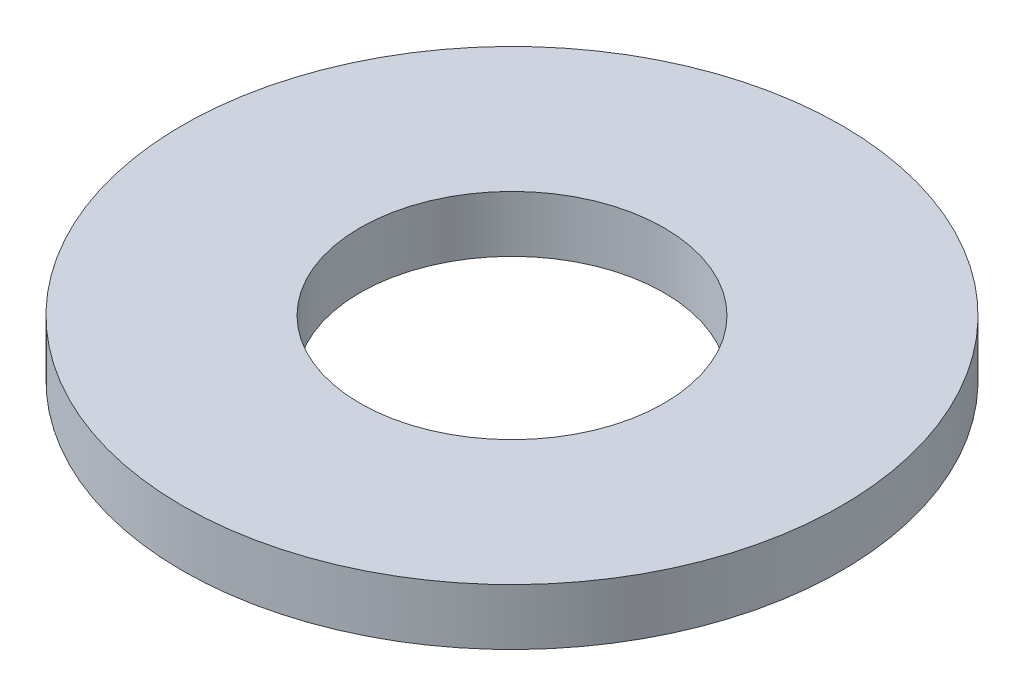
ISO-10303-21;
HEADER;
FILE_DESCRIPTION(('STEP AP214'),'2;1');
FILE_NAME('part.step','',(''),(''),'','','');
FILE_SCHEMA(('AUTOMOTIVE_DESIGN { 1 0 10303 214 1 1 1 1 }'));
ENDSEC;
DATA;
#1=APPLICATION_CONTEXT('core data for automotive mechanical design processes');
#2=APPLICATION_PROTOCOL_DEFINITION('international standard','automotive_design',2000,#1);
#3=PRODUCT_CONTEXT('',#1,'mechanical');
#4=PRODUCT('Part','Part','',(#3));
#5=PRODUCT_RELATED_PRODUCT_CATEGORY('part','',(#4));
#6=PRODUCT_DEFINITION_FORMATION('','',#4);
#7=PRODUCT_DEFINITION_CONTEXT('part definition',#1,'design');
#8=PRODUCT_DEFINITION('design','',#6,#7);
#9=PRODUCT_DEFINITION_SHAPE('','',#8);
#10=(LENGTH_UNIT() NAMED_UNIT(*) SI_UNIT(.MILLI.,.METRE.));
#11=(NAMED_UNIT(*) PLANE_ANGLE_UNIT() SI_UNIT($,.RADIAN.));
#12=(NAMED_UNIT(*) SI_UNIT($,.STERADIAN.) SOLID_ANGLE_UNIT());
#13=UNCERTAINTY_MEASURE_WITH_UNIT(LENGTH_MEASURE(1.E-05),#10,'distance_accuracy_value','');
#14=(GEOMETRIC_REPRESENTATION_CONTEXT(3) GLOBAL_UNCERTAINTY_ASSIGNED_CONTEXT((#13)) GLOBAL_UNIT_ASSIGNED_CONTEXT((#10,
#11,#12)) REPRESENTATION_CONTEXT('',''));
#15=CARTESIAN_POINT('',(0.,0.,0.));
#16=DIRECTION('',(0.,0.,1.));
#17=DIRECTION('',(1.,0.,0.));
#18=AXIS2_PLACEMENT_3D('',#15,#16,#17);
#19=CARTESIAN_POINT('',(0.,0.8128,0.));
#20=DIRECTION('',(0.,1.,0.));
#21=DIRECTION('',(0.,0.,1.));
#22=AXIS2_PLACEMENT_3D('',#19,#20,#21);
#23=PLANE('',#22);
#24=CARTESIAN_POINT('',(0.,0.8128,0.));
#25=DIRECTION('',(0.,-1.,0.));
#26=DIRECTION('',(0.,0.,-1.));
#27=AXIS2_PLACEMENT_3D('',#24,#25,#26);
#28=CIRCLE('',#27,2.1971);
#29=CARTESIAN_POINT('',(0.,0.8128,-2.1971));
#30=VERTEX_POINT('',#29);
#31=EDGE_CURVE('E26',#30,#30,#28,.T.);
#32=ORIENTED_EDGE('',*,*,#31,.T.);
#33=EDGE_LOOP('',(#32));
#34=FACE_BOUND('',#33,.T.);
#35=CARTESIAN_POINT('',(0.,0.8128,0.));
#36=DIRECTION('',(0.,-1.,0.));
#37=DIRECTION('',(0.,0.,-1.));
#38=AXIS2_PLACEMENT_3D('',#35,#36,#37);
#39=CIRCLE('',#38,4.7625);
#40=CARTESIAN_POINT('',(0.,0.8128,-4.7625));
#41=VERTEX_POINT('',#40);
#42=EDGE_CURVE('E17',#41,#41,#39,.T.);
#43=ORIENTED_EDGE('',*,*,#42,.F.);
#44=EDGE_LOOP('',(#43));
#45=FACE_BOUND('',#44,.T.);
#46=ADVANCED_FACE('F14',(#34,#45),#23,.T.);
#47=CARTESIAN_POINT('',(0.,0.8128,0.));
#48=DIRECTION('',(0.,-1.,0.));
#49=DIRECTION('',(0.,0.,-1.));
#50=AXIS2_PLACEMENT_3D('',#47,#48,#49);
#51=CYLINDRICAL_SURFACE('',#50,4.7625);
#52=ORIENTED_EDGE('',*,*,#42,.T.);
#53=EDGE_LOOP('',(#52));
#54=FACE_BOUND('',#53,.T.);
#55=CARTESIAN_POINT('',(0.,0.,0.));
#56=DIRECTION('',(0.,-1.,0.));
#57=DIRECTION('',(0.,0.,-1.));
#58=AXIS2_PLACEMENT_3D('',#55,#56,#57);
#59=CIRCLE('',#58,4.7625);
#60=CARTESIAN_POINT('',(0.,0.,-4.7625));
#61=VERTEX_POINT('',#60);
#62=EDGE_CURVE('E21',#61,#61,#59,.F.);
#63=ORIENTED_EDGE('',*,*,#62,.T.);
#64=EDGE_LOOP('',(#63));
#65=FACE_BOUND('',#64,.T.);
#66=ADVANCED_FACE('F34',(#54,#65),#51,.T.);
#67=CARTESIAN_POINT('',(0.,0.8128,0.));
#68=DIRECTION('',(0.,-1.,0.));
#69=DIRECTION('',(0.,0.,-1.));
#70=AXIS2_PLACEMENT_3D('',#67,#68,#69);
#71=CYLINDRICAL_SURFACE('',#70,2.1971);
#72=CARTESIAN_POINT('',(0.,0.,0.));
#73=DIRECTION('',(0.,-1.,0.));
#74=DIRECTION('',(0.,0.,-1.));
#75=AXIS2_PLACEMENT_3D('',#72,#73,#74);
#76=CIRCLE('',#75,2.1971);
#77=CARTESIAN_POINT('',(0.,0.,-2.1971));
#78=VERTEX_POINT('',#77);
#79=EDGE_CURVE('E9',#78,#78,#76,.T.);
#80=ORIENTED_EDGE('',*,*,#79,.T.);
#81=EDGE_LOOP('',(#80));
#82=FACE_BOUND('',#81,.T.);
#83=ORIENTED_EDGE('',*,*,#31,.F.);
#84=EDGE_LOOP('',(#83));
#85=FACE_BOUND('',#84,.T.);
#86=ADVANCED_FACE('F42',(#82,#85),#71,.F.);
#87=CARTESIAN_POINT('',(0.,0.,0.));
#88=DIRECTION('',(0.,1.,0.));
#89=DIRECTION('',(0.,0.,1.));
#90=AXIS2_PLACEMENT_3D('',#87,#88,#89);
#91=PLANE('',#90);
#92=ORIENTED_EDGE('',*,*,#79,.F.);
#93=EDGE_LOOP('',(#92));
#94=FACE_BOUND('',#93,.T.);
#95=ORIENTED_EDGE('',*,*,#62,.F.);
#96=EDGE_LOOP('',(#95));
#97=FACE_BOUND('',#96,.T.);
#98=ADVANCED_FACE('F43',(#94,#97),#91,.F.);
#99=CLOSED_SHELL('',(#46,#66,#86,#98));
#100=MANIFOLD_SOLID_BREP('B1',#99);
#101=ADVANCED_BREP_SHAPE_REPRESENTATION('',(#18,#100),#14);
#102=SHAPE_DEFINITION_REPRESENTATION(#9,#101);
ENDSEC;
END-ISO-10303-21;
